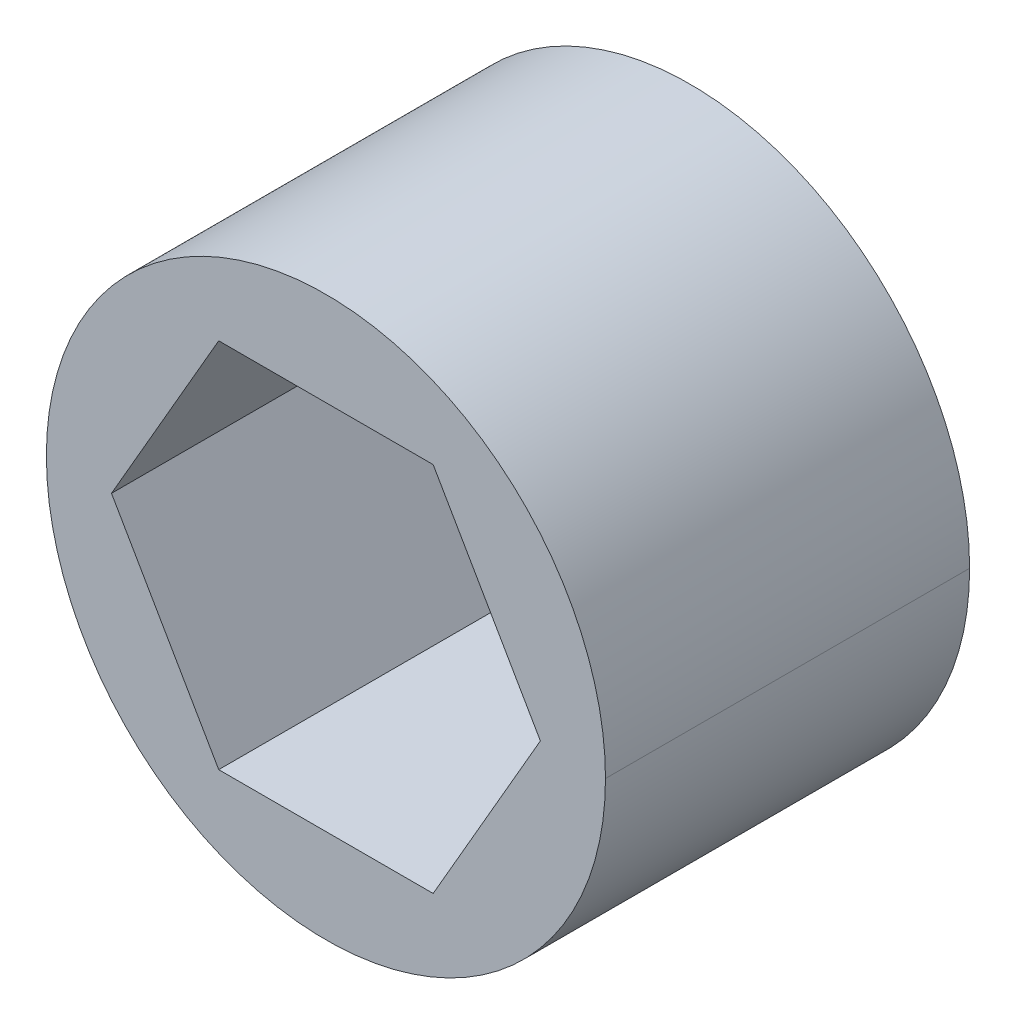
ISO-10303-21;
HEADER;
FILE_DESCRIPTION(('STEP AP214'),'2;1');
FILE_NAME('part.step','',(''),(''),'','','');
FILE_SCHEMA(('AUTOMOTIVE_DESIGN { 1 0 10303 214 1 1 1 1 }'));
ENDSEC;
DATA;
#1=APPLICATION_CONTEXT('core data for automotive mechanical design processes');
#2=APPLICATION_PROTOCOL_DEFINITION('international standard','automotive_design',2000,#1);
#3=PRODUCT_CONTEXT('',#1,'mechanical');
#4=PRODUCT('Part','Part','',(#3));
#5=PRODUCT_RELATED_PRODUCT_CATEGORY('part','',(#4));
#6=PRODUCT_DEFINITION_FORMATION('','',#4);
#7=PRODUCT_DEFINITION_CONTEXT('part definition',#1,'design');
#8=PRODUCT_DEFINITION('design','',#6,#7);
#9=PRODUCT_DEFINITION_SHAPE('','',#8);
#10=(LENGTH_UNIT() NAMED_UNIT(*) SI_UNIT(.MILLI.,.METRE.));
#11=(NAMED_UNIT(*) PLANE_ANGLE_UNIT() SI_UNIT($,.RADIAN.));
#12=(NAMED_UNIT(*) SI_UNIT($,.STERADIAN.) SOLID_ANGLE_UNIT());
#13=UNCERTAINTY_MEASURE_WITH_UNIT(LENGTH_MEASURE(1.E-05),#10,'distance_accuracy_value','');
#14=(GEOMETRIC_REPRESENTATION_CONTEXT(3) GLOBAL_UNCERTAINTY_ASSIGNED_CONTEXT((#13)) GLOBAL_UNIT_ASSIGNED_CONTEXT((#10,
#11,#12)) REPRESENTATION_CONTEXT('',''));
#15=CARTESIAN_POINT('',(0.,0.,0.));
#16=DIRECTION('',(0.,0.,1.));
#17=DIRECTION('',(1.,0.,0.));
#18=AXIS2_PLACEMENT_3D('',#15,#16,#17);
#19=CARTESIAN_POINT('',(-7.47899538708241,0.,6.35));
#20=DIRECTION('',(0.866025403784439,0.5,0.));
#21=DIRECTION('',(0.,0.,-1.));
#22=AXIS2_PLACEMENT_3D('',#19,#20,#21);
#23=PLANE('',#22);
#24=DIRECTION('',(0.5,-0.866025403784439,0.));
#25=VECTOR('',#24,1.);
#26=CARTESIAN_POINT('',(-7.47899538708241,0.,-6.35));
#27=LINE('',#26,#25);
#28=CARTESIAN_POINT('',(-7.47899538708241,0.,-6.35));
#29=VERTEX_POINT('',#28);
#30=CARTESIAN_POINT('',(-3.73949769354121,-6.477,-6.35));
#31=VERTEX_POINT('',#30);
#32=EDGE_CURVE('E134',#29,#31,#27,.T.);
#33=ORIENTED_EDGE('',*,*,#32,.F.);
#34=DIRECTION('',(0.,0.,-1.));
#35=VECTOR('',#34,1.);
#36=CARTESIAN_POINT('',(-7.47899538708241,0.,6.35));
#37=LINE('',#36,#35);
#38=CARTESIAN_POINT('',(-7.47899538708242,0.,6.35));
#39=VERTEX_POINT('',#38);
#40=EDGE_CURVE('E10',#39,#29,#37,.T.);
#41=ORIENTED_EDGE('',*,*,#40,.F.);
#42=DIRECTION('',(0.5,-0.866025403784439,0.));
#43=VECTOR('',#42,1.);
#44=CARTESIAN_POINT('',(-7.47899538708241,0.,6.35));
#45=LINE('',#44,#43);
#46=CARTESIAN_POINT('',(-3.7394976935412,-6.477,6.35));
#47=VERTEX_POINT('',#46);
#48=EDGE_CURVE('E123',#39,#47,#45,.T.);
#49=ORIENTED_EDGE('',*,*,#48,.T.);
#50=DIRECTION('',(0.,0.,-1.));
#51=VECTOR('',#50,1.);
#52=CARTESIAN_POINT('',(-3.7394976935412,-6.477,6.35));
#53=LINE('',#52,#51);
#54=EDGE_CURVE('E138',#47,#31,#53,.T.);
#55=ORIENTED_EDGE('',*,*,#54,.T.);
#56=EDGE_LOOP('',(#33,#41,#49,#55));
#57=FACE_BOUND('',#56,.T.);
#58=ADVANCED_FACE('F15',(#57),#23,.T.);
#59=CARTESIAN_POINT('',(-3.73949769354121,6.477,6.35));
#60=DIRECTION('',(0.866025403784439,-0.5,0.));
#61=DIRECTION('',(0.,0.,-1.));
#62=AXIS2_PLACEMENT_3D('',#59,#60,#61);
#63=PLANE('',#62);
#64=DIRECTION('',(-0.5,-0.866025403784439,0.));
#65=VECTOR('',#64,1.);
#66=CARTESIAN_POINT('',(-3.73949769354121,6.477,-6.35));
#67=LINE('',#66,#65);
#68=CARTESIAN_POINT('',(-3.73949769354121,6.477,-6.35));
#69=VERTEX_POINT('',#68);
#70=EDGE_CURVE('E19',#69,#29,#67,.T.);
#71=ORIENTED_EDGE('',*,*,#70,.F.);
#72=DIRECTION('',(0.,0.,-1.));
#73=VECTOR('',#72,1.);
#74=CARTESIAN_POINT('',(-3.73949769354121,6.477,6.35));
#75=LINE('',#74,#73);
#76=CARTESIAN_POINT('',(-3.73949769354121,6.477,6.35));
#77=VERTEX_POINT('',#76);
#78=EDGE_CURVE('E26',#77,#69,#75,.T.);
#79=ORIENTED_EDGE('',*,*,#78,.F.);
#80=DIRECTION('',(-0.5,-0.866025403784439,0.));
#81=VECTOR('',#80,1.);
#82=CARTESIAN_POINT('',(-3.73949769354121,6.477,6.35));
#83=LINE('',#82,#81);
#84=EDGE_CURVE('E127',#77,#39,#83,.T.);
#85=ORIENTED_EDGE('',*,*,#84,.T.);
#86=ORIENTED_EDGE('',*,*,#40,.T.);
#87=EDGE_LOOP('',(#71,#79,#85,#86));
#88=FACE_BOUND('',#87,.T.);
#89=ADVANCED_FACE('F17',(#88),#63,.T.);
#90=CARTESIAN_POINT('',(3.7394976935412,6.477,6.35));
#91=DIRECTION('',(0.,-1.,0.));
#92=DIRECTION('',(0.,0.,-1.));
#93=AXIS2_PLACEMENT_3D('',#90,#91,#92);
#94=PLANE('',#93);
#95=DIRECTION('',(-1.,0.,0.));
#96=VECTOR('',#95,1.);
#97=CARTESIAN_POINT('',(3.7394976935412,6.477,-6.35));
#98=LINE('',#97,#96);
#99=CARTESIAN_POINT('',(3.7394976935412,6.477,-6.35));
#100=VERTEX_POINT('',#99);
#101=EDGE_CURVE('E158',#100,#69,#98,.T.);
#102=ORIENTED_EDGE('',*,*,#101,.F.);
#103=DIRECTION('',(0.,0.,-1.));
#104=VECTOR('',#103,1.);
#105=CARTESIAN_POINT('',(3.7394976935412,6.477,6.35));
#106=LINE('',#105,#104);
#107=CARTESIAN_POINT('',(3.7394976935412,6.477,6.35));
#108=VERTEX_POINT('',#107);
#109=EDGE_CURVE('E142',#108,#100,#106,.T.);
#110=ORIENTED_EDGE('',*,*,#109,.F.);
#111=DIRECTION('',(-1.,0.,0.));
#112=VECTOR('',#111,1.);
#113=CARTESIAN_POINT('',(3.7394976935412,6.477,6.35));
#114=LINE('',#113,#112);
#115=EDGE_CURVE('E133',#108,#77,#114,.T.);
#116=ORIENTED_EDGE('',*,*,#115,.T.);
#117=ORIENTED_EDGE('',*,*,#78,.T.);
#118=EDGE_LOOP('',(#102,#110,#116,#117));
#119=FACE_BOUND('',#118,.T.);
#120=ADVANCED_FACE('F228',(#119),#94,.T.);
#121=CARTESIAN_POINT('',(7.47899538708241,0.,6.35));
#122=DIRECTION('',(-0.866025403784439,-0.5,0.));
#123=DIRECTION('',(-0.5,0.866025403784439,0.));
#124=AXIS2_PLACEMENT_3D('',#121,#122,#123);
#125=PLANE('',#124);
#126=DIRECTION('',(-0.5,0.866025403784439,0.));
#127=VECTOR('',#126,1.);
#128=CARTESIAN_POINT('',(7.47899538708241,0.,-6.35));
#129=LINE('',#128,#127);
#130=CARTESIAN_POINT('',(7.47899538708241,0.,-6.35));
#131=VERTEX_POINT('',#130);
#132=EDGE_CURVE('E153',#131,#100,#129,.T.);
#133=ORIENTED_EDGE('',*,*,#132,.F.);
#134=DIRECTION('',(0.,0.,-1.));
#135=VECTOR('',#134,1.);
#136=CARTESIAN_POINT('',(7.47899538708241,0.,6.35));
#137=LINE('',#136,#135);
#138=CARTESIAN_POINT('',(7.47899538708241,0.,6.35));
#139=VERTEX_POINT('',#138);
#140=EDGE_CURVE('E139',#139,#131,#137,.T.);
#141=ORIENTED_EDGE('',*,*,#140,.F.);
#142=DIRECTION('',(-0.5,0.866025403784439,0.));
#143=VECTOR('',#142,1.);
#144=CARTESIAN_POINT('',(7.47899538708241,0.,6.35));
#145=LINE('',#144,#143);
#146=EDGE_CURVE('E129',#139,#108,#145,.T.);
#147=ORIENTED_EDGE('',*,*,#146,.T.);
#148=ORIENTED_EDGE('',*,*,#109,.T.);
#149=EDGE_LOOP('',(#133,#141,#147,#148));
#150=FACE_BOUND('',#149,.T.);
#151=ADVANCED_FACE('F232',(#150),#125,.T.);
#152=CARTESIAN_POINT('',(3.7394976935412,-6.477,6.35));
#153=DIRECTION('',(-0.866025403784439,0.5,0.));
#154=DIRECTION('',(0.,0.,1.));
#155=AXIS2_PLACEMENT_3D('',#152,#153,#154);
#156=PLANE('',#155);
#157=DIRECTION('',(0.5,0.866025403784439,0.));
#158=VECTOR('',#157,1.);
#159=CARTESIAN_POINT('',(3.7394976935412,-6.477,-6.35));
#160=LINE('',#159,#158);
#161=CARTESIAN_POINT('',(3.7394976935412,-6.477,-6.35));
#162=VERTEX_POINT('',#161);
#163=EDGE_CURVE('E149',#162,#131,#160,.T.);
#164=ORIENTED_EDGE('',*,*,#163,.F.);
#165=DIRECTION('',(0.,0.,-1.));
#166=VECTOR('',#165,1.);
#167=CARTESIAN_POINT('',(3.7394976935412,-6.477,6.35));
#168=LINE('',#167,#166);
#169=CARTESIAN_POINT('',(3.7394976935412,-6.477,6.35));
#170=VERTEX_POINT('',#169);
#171=EDGE_CURVE('E143',#170,#162,#168,.T.);
#172=ORIENTED_EDGE('',*,*,#171,.F.);
#173=DIRECTION('',(0.5,0.866025403784439,0.));
#174=VECTOR('',#173,1.);
#175=CARTESIAN_POINT('',(3.7394976935412,-6.477,6.35));
#176=LINE('',#175,#174);
#177=EDGE_CURVE('E100',#170,#139,#176,.T.);
#178=ORIENTED_EDGE('',*,*,#177,.T.);
#179=ORIENTED_EDGE('',*,*,#140,.T.);
#180=EDGE_LOOP('',(#164,#172,#178,#179));
#181=FACE_BOUND('',#180,.T.);
#182=ADVANCED_FACE('F272',(#181),#156,.T.);
#183=CARTESIAN_POINT('',(-3.7394976935412,-6.477,6.35));
#184=DIRECTION('',(0.,1.,0.));
#185=DIRECTION('',(1.,0.,0.));
#186=AXIS2_PLACEMENT_3D('',#183,#184,#185);
#187=PLANE('',#186);
#188=DIRECTION('',(1.,0.,0.));
#189=VECTOR('',#188,1.);
#190=CARTESIAN_POINT('',(-3.7394976935412,-6.477,-6.35));
#191=LINE('',#190,#189);
#192=EDGE_CURVE('E154',#31,#162,#191,.T.);
#193=ORIENTED_EDGE('',*,*,#192,.F.);
#194=ORIENTED_EDGE('',*,*,#54,.F.);
#195=DIRECTION('',(1.,0.,0.));
#196=VECTOR('',#195,1.);
#197=CARTESIAN_POINT('',(-3.7394976935412,-6.477,6.35));
#198=LINE('',#197,#196);
#199=EDGE_CURVE('E128',#47,#170,#198,.T.);
#200=ORIENTED_EDGE('',*,*,#199,.T.);
#201=ORIENTED_EDGE('',*,*,#171,.T.);
#202=EDGE_LOOP('',(#193,#194,#200,#201));
#203=FACE_BOUND('',#202,.T.);
#204=ADVANCED_FACE('F198',(#203),#187,.T.);
#205=CARTESIAN_POINT('',(0.,0.,6.35));
#206=DIRECTION('',(0.,0.,-1.));
#207=DIRECTION('',(-1.,0.,0.));
#208=AXIS2_PLACEMENT_3D('',#205,#206,#207);
#209=CYLINDRICAL_SURFACE('',#208,9.75);
#210=DIRECTION('',(0.,0.,-1.));
#211=VECTOR('',#210,1.);
#212=CARTESIAN_POINT('',(9.75,0.,6.35));
#213=LINE('',#212,#211);
#214=CARTESIAN_POINT('',(9.75,0.,6.35));
#215=VERTEX_POINT('',#214);
#216=CARTESIAN_POINT('',(9.75,0.,-6.35));
#217=VERTEX_POINT('',#216);
#218=EDGE_CURVE('E104',#215,#217,#213,.T.);
#219=ORIENTED_EDGE('',*,*,#218,.F.);
#220=CARTESIAN_POINT('',(0.,0.,6.35));
#221=DIRECTION('',(0.,0.,1.));
#222=DIRECTION('',(1.,0.,0.));
#223=AXIS2_PLACEMENT_3D('',#220,#221,#222);
#224=CIRCLE('',#223,9.75);
#225=CARTESIAN_POINT('',(-9.75,0.,6.35));
#226=VERTEX_POINT('',#225);
#227=EDGE_CURVE('E91',#226,#215,#224,.T.);
#228=ORIENTED_EDGE('',*,*,#227,.F.);
#229=DIRECTION('',(0.,0.,-1.));
#230=VECTOR('',#229,1.);
#231=CARTESIAN_POINT('',(-9.75,0.,6.35));
#232=LINE('',#231,#230);
#233=CARTESIAN_POINT('',(-9.75,0.,-6.35));
#234=VERTEX_POINT('',#233);
#235=EDGE_CURVE('E101',#226,#234,#232,.T.);
#236=ORIENTED_EDGE('',*,*,#235,.T.);
#237=CARTESIAN_POINT('',(0.,0.,-6.35));
#238=DIRECTION('',(0.,0.,1.));
#239=DIRECTION('',(1.,0.,0.));
#240=AXIS2_PLACEMENT_3D('',#237,#238,#239);
#241=CIRCLE('',#240,9.75);
#242=EDGE_CURVE('E107',#234,#217,#241,.T.);
#243=ORIENTED_EDGE('',*,*,#242,.T.);
#244=EDGE_LOOP('',(#219,#228,#236,#243));
#245=FACE_BOUND('',#244,.T.);
#246=ADVANCED_FACE('F105',(#245),#209,.T.);
#247=CARTESIAN_POINT('',(0.,0.,-6.35));
#248=DIRECTION('',(0.,0.,1.));
#249=DIRECTION('',(1.,0.,0.));
#250=AXIS2_PLACEMENT_3D('',#247,#248,#249);
#251=PLANE('',#250);
#252=ORIENTED_EDGE('',*,*,#192,.T.);
#253=ORIENTED_EDGE('',*,*,#163,.T.);
#254=ORIENTED_EDGE('',*,*,#132,.T.);
#255=ORIENTED_EDGE('',*,*,#101,.T.);
#256=ORIENTED_EDGE('',*,*,#70,.T.);
#257=ORIENTED_EDGE('',*,*,#32,.T.);
#258=EDGE_LOOP('',(#252,#253,#254,#255,#256,#257));
#259=FACE_BOUND('',#258,.T.);
#260=ORIENTED_EDGE('',*,*,#242,.F.);
#261=CARTESIAN_POINT('',(0.,0.,-6.35));
#262=DIRECTION('',(0.,0.,1.));
#263=DIRECTION('',(1.,0.,0.));
#264=AXIS2_PLACEMENT_3D('',#261,#262,#263);
#265=CIRCLE('',#264,9.75);
#266=EDGE_CURVE('E112',#217,#234,#265,.T.);
#267=ORIENTED_EDGE('',*,*,#266,.F.);
#268=EDGE_LOOP('',(#260,#267));
#269=FACE_BOUND('',#268,.T.);
#270=ADVANCED_FACE('F194',(#259,#269),#251,.F.);
#271=CARTESIAN_POINT('',(0.,0.,6.35));
#272=DIRECTION('',(0.,0.,1.));
#273=DIRECTION('',(1.,0.,0.));
#274=AXIS2_PLACEMENT_3D('',#271,#272,#273);
#275=PLANE('',#274);
#276=ORIENTED_EDGE('',*,*,#177,.F.);
#277=ORIENTED_EDGE('',*,*,#199,.F.);
#278=ORIENTED_EDGE('',*,*,#48,.F.);
#279=ORIENTED_EDGE('',*,*,#84,.F.);
#280=ORIENTED_EDGE('',*,*,#115,.F.);
#281=ORIENTED_EDGE('',*,*,#146,.F.);
#282=EDGE_LOOP('',(#276,#277,#278,#279,#280,#281));
#283=FACE_BOUND('',#282,.T.);
#284=ORIENTED_EDGE('',*,*,#227,.T.);
#285=CARTESIAN_POINT('',(0.,0.,6.35));
#286=DIRECTION('',(0.,0.,1.));
#287=DIRECTION('',(1.,0.,0.));
#288=AXIS2_PLACEMENT_3D('',#285,#286,#287);
#289=CIRCLE('',#288,9.75);
#290=EDGE_CURVE('E95',#215,#226,#289,.T.);
#291=ORIENTED_EDGE('',*,*,#290,.T.);
#292=EDGE_LOOP('',(#284,#291));
#293=FACE_BOUND('',#292,.T.);
#294=ADVANCED_FACE('F93',(#283,#293),#275,.T.);
#295=CARTESIAN_POINT('',(0.,0.,6.35));
#296=DIRECTION('',(0.,0.,-1.));
#297=DIRECTION('',(-1.,0.,0.));
#298=AXIS2_PLACEMENT_3D('',#295,#296,#297);
#299=CYLINDRICAL_SURFACE('',#298,9.75);
#300=ORIENTED_EDGE('',*,*,#290,.F.);
#301=ORIENTED_EDGE('',*,*,#218,.T.);
#302=ORIENTED_EDGE('',*,*,#266,.T.);
#303=ORIENTED_EDGE('',*,*,#235,.F.);
#304=EDGE_LOOP('',(#300,#301,#302,#303));
#305=FACE_BOUND('',#304,.T.);
#306=ADVANCED_FACE('F114',(#305),#299,.T.);
#307=CLOSED_SHELL('',(#58,#89,#120,#151,#182,#204,#246,#270,#294,#306));
#308=MANIFOLD_SOLID_BREP('B1',#307);
#309=ADVANCED_BREP_SHAPE_REPRESENTATION('',(#18,#308),#14);
#310=SHAPE_DEFINITION_REPRESENTATION(#9,#309);
ENDSEC;
END-ISO-10303-21;
